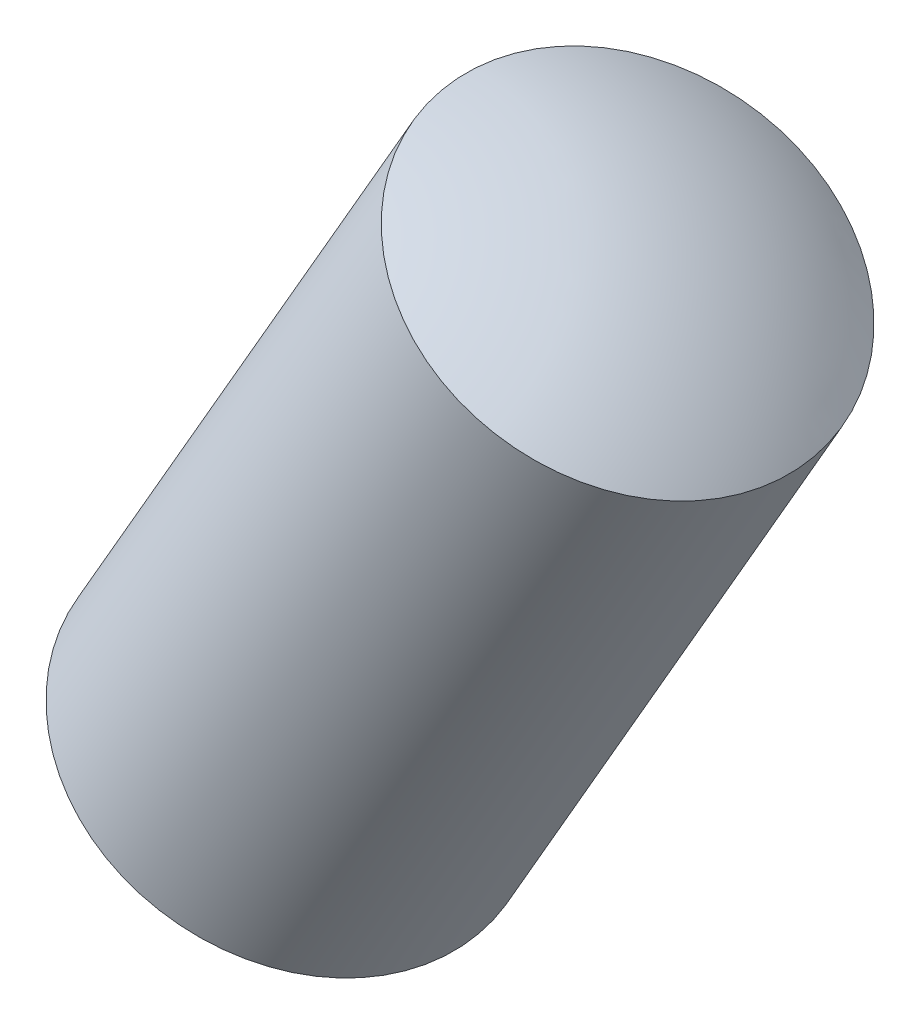
ISO-10303-21;
HEADER;
FILE_DESCRIPTION(('STEP AP214'),'2;1');
FILE_NAME('part.step','',(''),(''),'','','');
FILE_SCHEMA(('AUTOMOTIVE_DESIGN { 1 0 10303 214 1 1 1 1 }'));
ENDSEC;
DATA;
#1=APPLICATION_CONTEXT('core data for automotive mechanical design processes');
#2=APPLICATION_PROTOCOL_DEFINITION('international standard','automotive_design',2000,#1);
#3=PRODUCT_CONTEXT('',#1,'mechanical');
#4=PRODUCT('Part','Part','',(#3));
#5=PRODUCT_RELATED_PRODUCT_CATEGORY('part','',(#4));
#6=PRODUCT_DEFINITION_FORMATION('','',#4);
#7=PRODUCT_DEFINITION_CONTEXT('part definition',#1,'design');
#8=PRODUCT_DEFINITION('design','',#6,#7);
#9=PRODUCT_DEFINITION_SHAPE('','',#8);
#10=(LENGTH_UNIT() NAMED_UNIT(*) SI_UNIT(.MILLI.,.METRE.));
#11=(NAMED_UNIT(*) PLANE_ANGLE_UNIT() SI_UNIT($,.RADIAN.));
#12=(NAMED_UNIT(*) SI_UNIT($,.STERADIAN.) SOLID_ANGLE_UNIT());
#13=UNCERTAINTY_MEASURE_WITH_UNIT(LENGTH_MEASURE(1.E-05),#10,'distance_accuracy_value','');
#14=(GEOMETRIC_REPRESENTATION_CONTEXT(3) GLOBAL_UNCERTAINTY_ASSIGNED_CONTEXT((#13)) GLOBAL_UNIT_ASSIGNED_CONTEXT((#10,
#11,#12)) REPRESENTATION_CONTEXT('',''));
#15=CARTESIAN_POINT('',(0.,0.,0.));
#16=DIRECTION('',(0.,0.,1.));
#17=DIRECTION('',(1.,0.,0.));
#18=AXIS2_PLACEMENT_3D('',#15,#16,#17);
#19=CARTESIAN_POINT('',(-13.8009618943233,-23.90396719429,0.9));
#20=DIRECTION('',(-0.866025403784439,0.5,0.));
#21=DIRECTION('',(-0.5,-0.866025403784439,0.));
#22=AXIS2_PLACEMENT_3D('',#19,#20,#21);
#23=SPHERICAL_SURFACE('',#22,3.);
#24=CARTESIAN_POINT('',(-13.8009618943233,-23.90396719429,0.9));
#25=DIRECTION('',(0.5,0.866025403784439,0.));
#26=DIRECTION('',(0.,0.,-1.));
#27=AXIS2_PLACEMENT_3D('',#24,#25,#26);
#28=SPHERICAL_SURFACE('',#27,3.);
#29=CARTESIAN_POINT('',(-15.1,-26.15396719429,0.9));
#30=DIRECTION('',(0.5,0.866025403784439,0.));
#31=DIRECTION('',(0.,0.,-1.));
#32=AXIS2_PLACEMENT_3D('',#29,#30,#31);
#33=CIRCLE('',#32,1.5);
#34=CARTESIAN_POINT('',(-15.1,-26.15396719429,-0.6));
#35=VERTEX_POINT('',#34);
#36=EDGE_CURVE('E11',#35,#35,#33,.T.);
#37=ORIENTED_EDGE('',*,*,#36,.F.);
#38=EDGE_LOOP('',(#37));
#39=FACE_BOUND('',#38,.T.);
#40=ADVANCED_FACE('F17',(#39),#28,.T.);
#41=CARTESIAN_POINT('',(-13.6990381056767,-23.7274300138542,0.9));
#42=DIRECTION('',(-0.866025403784439,0.5,0.));
#43=DIRECTION('',(0.5,0.866025403784439,0.));
#44=AXIS2_PLACEMENT_3D('',#41,#42,#43);
#45=SPHERICAL_SURFACE('',#44,3.);
#46=CARTESIAN_POINT('',(-13.6990381056767,-23.7274300138542,0.9));
#47=DIRECTION('',(0.5,0.866025403784439,0.));
#48=DIRECTION('',(0.,0.,-1.));
#49=AXIS2_PLACEMENT_3D('',#46,#47,#48);
#50=SPHERICAL_SURFACE('',#49,3.);
#51=CARTESIAN_POINT('',(-12.4,-21.477430013854,0.9));
#52=DIRECTION('',(0.5,0.866025403784439,0.));
#53=DIRECTION('',(0.,0.,-1.));
#54=AXIS2_PLACEMENT_3D('',#51,#52,#53);
#55=CIRCLE('',#54,1.5);
#56=CARTESIAN_POINT('',(-12.4,-21.477430013854,-0.6));
#57=VERTEX_POINT('',#56);
#58=EDGE_CURVE('E21',#57,#57,#55,.T.);
#59=ORIENTED_EDGE('',*,*,#58,.T.);
#60=EDGE_LOOP('',(#59));
#61=FACE_BOUND('',#60,.T.);
#62=ADVANCED_FACE('F40',(#61),#50,.T.);
#63=CARTESIAN_POINT('',(-13.075,-22.6465643089631,0.9));
#64=DIRECTION('',(0.5,0.866025403784439,0.));
#65=DIRECTION('',(0.,0.,-1.));
#66=AXIS2_PLACEMENT_3D('',#63,#64,#65);
#67=CYLINDRICAL_SURFACE('',#66,1.5);
#68=ORIENTED_EDGE('',*,*,#36,.T.);
#69=EDGE_LOOP('',(#68));
#70=FACE_BOUND('',#69,.T.);
#71=ORIENTED_EDGE('',*,*,#58,.F.);
#72=EDGE_LOOP('',(#71));
#73=FACE_BOUND('',#72,.T.);
#74=ADVANCED_FACE('F19',(#70,#73),#67,.T.);
#75=CLOSED_SHELL('',(#40,#62,#74));
#76=MANIFOLD_SOLID_BREP('B1',#75);
#77=ADVANCED_BREP_SHAPE_REPRESENTATION('',(#18,#76),#14);
#78=SHAPE_DEFINITION_REPRESENTATION(#9,#77);
ENDSEC;
END-ISO-10303-21;
